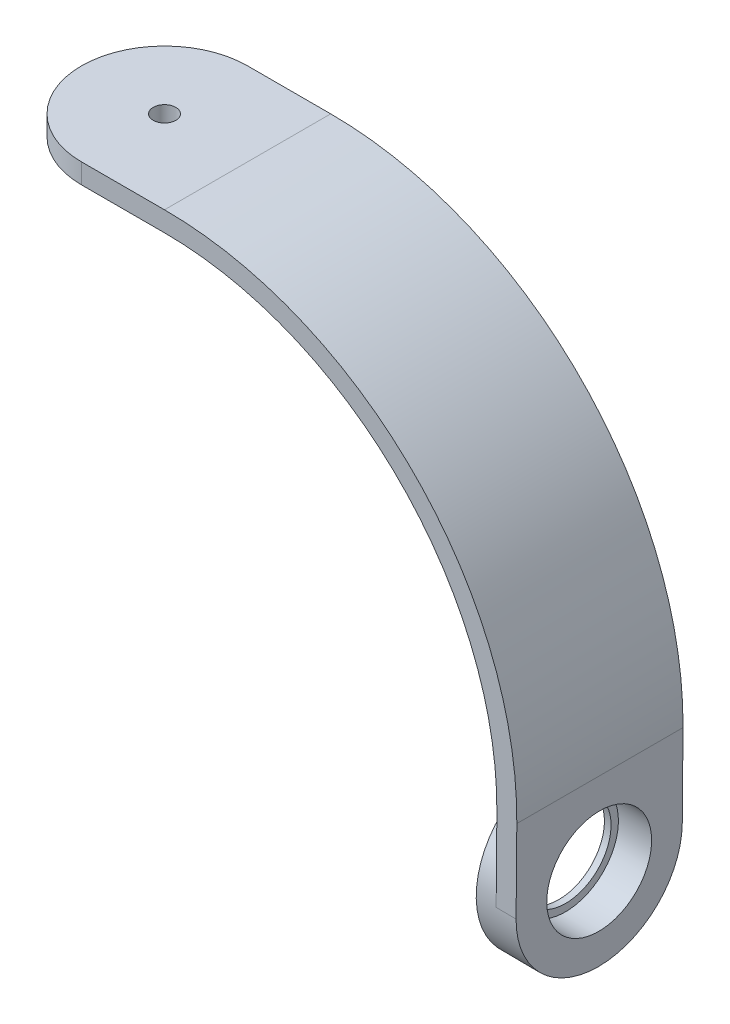
ISO-10303-21;
HEADER;
FILE_DESCRIPTION(('STEP AP214'),'2;1');
FILE_NAME('part.step','',(''),(''),'','','');
FILE_SCHEMA(('AUTOMOTIVE_DESIGN { 1 0 10303 214 1 1 1 1 }'));
ENDSEC;
DATA;
#1=APPLICATION_CONTEXT('core data for automotive mechanical design processes');
#2=APPLICATION_PROTOCOL_DEFINITION('international standard','automotive_design',2000,#1);
#3=PRODUCT_CONTEXT('',#1,'mechanical');
#4=PRODUCT('Part','Part','',(#3));
#5=PRODUCT_RELATED_PRODUCT_CATEGORY('part','',(#4));
#6=PRODUCT_DEFINITION_FORMATION('','',#4);
#7=PRODUCT_DEFINITION_CONTEXT('part definition',#1,'design');
#8=PRODUCT_DEFINITION('design','',#6,#7);
#9=PRODUCT_DEFINITION_SHAPE('','',#8);
#10=(LENGTH_UNIT() NAMED_UNIT(*) SI_UNIT(.MILLI.,.METRE.));
#11=(NAMED_UNIT(*) PLANE_ANGLE_UNIT() SI_UNIT($,.RADIAN.));
#12=(NAMED_UNIT(*) SI_UNIT($,.STERADIAN.) SOLID_ANGLE_UNIT());
#13=UNCERTAINTY_MEASURE_WITH_UNIT(LENGTH_MEASURE(1.E-05),#10,'distance_accuracy_value','');
#14=(GEOMETRIC_REPRESENTATION_CONTEXT(3) GLOBAL_UNCERTAINTY_ASSIGNED_CONTEXT((#13)) GLOBAL_UNIT_ASSIGNED_CONTEXT((#10,
#11,#12)) REPRESENTATION_CONTEXT('',''));
#15=CARTESIAN_POINT('',(0.,0.,0.));
#16=DIRECTION('',(0.,0.,1.));
#17=DIRECTION('',(1.,0.,0.));
#18=AXIS2_PLACEMENT_3D('',#15,#16,#17);
#19=CARTESIAN_POINT('',(46.8891286902864,-12.9096712067259,12.5));
#20=DIRECTION('',(0.999961923064171,-0.00872653549837705,0.));
#21=DIRECTION('',(0.00872653549837705,0.999961923064171,0.));
#22=AXIS2_PLACEMENT_3D('',#19,#20,#21);
#23=CYLINDRICAL_SURFACE('',#22,6.79);
#24=CARTESIAN_POINT('',(46.8891286902864,-12.9096712067259,12.5));
#25=DIRECTION('',(-0.999961923064171,0.00872653549837705,0.));
#26=DIRECTION('',(-0.00872653549837705,-0.999961923064171,0.));
#27=AXIS2_PLACEMENT_3D('',#24,#25,#26);
#28=CIRCLE('',#27,6.79);
#29=CARTESIAN_POINT('',(46.8298755142524,-19.6994126643316,12.5));
#30=VERTEX_POINT('',#29);
#31=EDGE_CURVE('E317',#30,#30,#28,.T.);
#32=ORIENTED_EDGE('',*,*,#31,.T.);
#33=EDGE_LOOP('',(#32));
#34=FACE_BOUND('',#33,.T.);
#35=CARTESIAN_POINT('',(47.8890906133506,-12.9183977422242,12.5));
#36=DIRECTION('',(0.999961923064171,-0.00872653549837732,0.));
#37=DIRECTION('',(0.00872653549837732,0.999961923064171,0.));
#38=AXIS2_PLACEMENT_3D('',#35,#36,#37);
#39=CIRCLE('',#38,6.79);
#40=CARTESIAN_POINT('',(47.9483437893845,-6.12865628461852,12.5));
#41=VERTEX_POINT('',#40);
#42=EDGE_CURVE('E49',#41,#41,#39,.T.);
#43=ORIENTED_EDGE('',*,*,#42,.T.);
#44=EDGE_LOOP('',(#43));
#45=FACE_BOUND('',#44,.T.);
#46=ADVANCED_FACE('F45',(#34,#45),#23,.F.);
#47=CARTESIAN_POINT('',(49.9980961532086,-0.436326774918869,25.));
#48=DIRECTION('',(0.999961923064171,-0.00872653549837705,0.));
#49=DIRECTION('',(0.00872653549837705,0.999961923064171,0.));
#50=AXIS2_PLACEMENT_3D('',#47,#48,#49);
#51=PLANE('',#50);
#52=CARTESIAN_POINT('',(49.8890144594789,-12.935850813221,12.5));
#53=DIRECTION('',(-0.999961923064171,0.00872653549837705,0.));
#54=DIRECTION('',(-0.00872653549837705,-0.999961923064171,0.));
#55=AXIS2_PLACEMENT_3D('',#52,#53,#54);
#56=CIRCLE('',#55,12.5);
#57=CARTESIAN_POINT('',(49.9980961532086,-0.436326774918864,12.5));
#58=VERTEX_POINT('',#57);
#59=CARTESIAN_POINT('',(49.8890144594788,-12.935850813221,0.));
#60=VERTEX_POINT('',#59);
#61=EDGE_CURVE('E63',#58,#60,#56,.T.);
#62=ORIENTED_EDGE('',*,*,#61,.F.);
#63=DIRECTION('',(0.,0.,-1.));
#64=VECTOR('',#63,1.);
#65=CARTESIAN_POINT('',(49.9980961532086,-0.436326774918869,25.));
#66=LINE('',#65,#64);
#67=CARTESIAN_POINT('',(49.9980961532086,-0.436326774918869,0.));
#68=VERTEX_POINT('',#67);
#69=EDGE_CURVE('E218',#58,#68,#66,.T.);
#70=ORIENTED_EDGE('',*,*,#69,.T.);
#71=DIRECTION('',(-0.00872653549837705,-0.999961923064171,0.));
#72=VECTOR('',#71,1.);
#73=CARTESIAN_POINT('',(49.9980961532086,-0.436326774918869,0.));
#74=LINE('',#73,#72);
#75=EDGE_CURVE('E254',#68,#60,#74,.T.);
#76=ORIENTED_EDGE('',*,*,#75,.T.);
#77=EDGE_LOOP('',(#62,#70,#76));
#78=FACE_BOUND('',#77,.T.);
#79=ADVANCED_FACE('F271',(#78),#51,.F.);
#80=CARTESIAN_POINT('',(0.,0.,25.));
#81=DIRECTION('',(0.,0.,-1.));
#82=DIRECTION('',(-1.,0.,0.));
#83=AXIS2_PLACEMENT_3D('',#80,#81,#82);
#84=CYLINDRICAL_SURFACE('',#83,50.);
#85=CARTESIAN_POINT('',(0.,0.,0.));
#86=DIRECTION('',(0.,0.,-1.));
#87=DIRECTION('',(-1.,0.,0.));
#88=AXIS2_PLACEMENT_3D('',#85,#86,#87);
#89=CIRCLE('',#88,50.);
#90=CARTESIAN_POINT('',(0.,50.,0.));
#91=VERTEX_POINT('',#90);
#92=EDGE_CURVE('E143',#91,#68,#89,.T.);
#93=ORIENTED_EDGE('',*,*,#92,.T.);
#94=ORIENTED_EDGE('',*,*,#69,.F.);
#95=CARTESIAN_POINT('',(49.9980961532086,-0.436326774918869,25.));
#96=VERTEX_POINT('',#95);
#97=EDGE_CURVE('E219',#96,#58,#66,.T.);
#98=ORIENTED_EDGE('',*,*,#97,.F.);
#99=CARTESIAN_POINT('',(0.,0.,25.));
#100=DIRECTION('',(0.,0.,-1.));
#101=DIRECTION('',(-1.,0.,0.));
#102=AXIS2_PLACEMENT_3D('',#99,#100,#101);
#103=CIRCLE('',#102,50.);
#104=CARTESIAN_POINT('',(0.,50.,25.));
#105=VERTEX_POINT('',#104);
#106=EDGE_CURVE('E202',#105,#96,#103,.T.);
#107=ORIENTED_EDGE('',*,*,#106,.F.);
#108=DIRECTION('',(0.,0.,-1.));
#109=VECTOR('',#108,1.);
#110=CARTESIAN_POINT('',(0.,50.,25.));
#111=LINE('',#110,#109);
#112=EDGE_CURVE('E208',#105,#91,#111,.T.);
#113=ORIENTED_EDGE('',*,*,#112,.T.);
#114=EDGE_LOOP('',(#93,#94,#98,#107,#113));
#115=FACE_BOUND('',#114,.T.);
#116=ADVANCED_FACE('F279',(#115),#84,.F.);
#117=CARTESIAN_POINT('',(49.8890144594788,-12.935850813221,25.));
#118=VERTEX_POINT('',#117);
#119=EDGE_CURVE('E323',#118,#58,#56,.T.);
#120=ORIENTED_EDGE('',*,*,#119,.F.);
#121=DIRECTION('',(-0.00872653549837705,-0.999961923064171,0.));
#122=VECTOR('',#121,1.);
#123=CARTESIAN_POINT('',(49.9980961532086,-0.436326774918869,25.));
#124=LINE('',#123,#122);
#125=EDGE_CURVE('E237',#96,#118,#124,.T.);
#126=ORIENTED_EDGE('',*,*,#125,.F.);
#127=ORIENTED_EDGE('',*,*,#97,.T.);
#128=EDGE_LOOP('',(#120,#126,#127));
#129=FACE_BOUND('',#128,.T.);
#130=ADVANCED_FACE('F267',(#129),#51,.F.);
#131=CARTESIAN_POINT('',(52.7798185349417,-25.4615544580183,25.));
#132=DIRECTION('',(-0.999961923064171,0.00872653549837732,0.));
#133=DIRECTION('',(-0.00872653549837732,-0.999961923064171,0.));
#134=AXIS2_PLACEMENT_3D('',#131,#132,#133);
#135=PLANE('',#134);
#136=CARTESIAN_POINT('',(52.8889002286714,-12.9620304197161,12.5));
#137=DIRECTION('',(0.999961923064171,-0.00872653549837746,0.));
#138=DIRECTION('',(0.00872653549837746,0.999961923064171,0.));
#139=AXIS2_PLACEMENT_3D('',#136,#137,#138);
#140=CIRCLE('',#139,7.89);
#141=CARTESIAN_POINT('',(52.9577525937536,-5.07233084673982,12.5));
#142=VERTEX_POINT('',#141);
#143=EDGE_CURVE('E137',#142,#142,#140,.T.);
#144=ORIENTED_EDGE('',*,*,#143,.F.);
#145=EDGE_LOOP('',(#144));
#146=FACE_BOUND('',#145,.T.);
#147=CARTESIAN_POINT('',(52.8889002286714,-12.9620304197161,12.5));
#148=DIRECTION('',(-0.999961923064171,0.00872653549837732,0.));
#149=DIRECTION('',(-0.00872653549837732,-0.999961923064171,0.));
#150=AXIS2_PLACEMENT_3D('',#147,#148,#149);
#151=CIRCLE('',#150,12.5);
#152=CARTESIAN_POINT('',(52.8889002286714,-12.9620304197161,25.));
#153=VERTEX_POINT('',#152);
#154=CARTESIAN_POINT('',(52.7798185349417,-25.4615544580183,12.5));
#155=VERTEX_POINT('',#154);
#156=EDGE_CURVE('E223',#153,#155,#151,.F.);
#157=ORIENTED_EDGE('',*,*,#156,.T.);
#158=CARTESIAN_POINT('',(52.8889002286714,-12.9620304197161,12.5));
#159=DIRECTION('',(-0.999961923064171,0.00872653549837732,0.));
#160=DIRECTION('',(-0.00872653549837732,-0.999961923064171,0.));
#161=AXIS2_PLACEMENT_3D('',#158,#159,#160);
#162=CIRCLE('',#161,12.5);
#163=CARTESIAN_POINT('',(52.8889002286714,-12.9620304197161,0.));
#164=VERTEX_POINT('',#163);
#165=EDGE_CURVE('E135',#155,#164,#162,.F.);
#166=ORIENTED_EDGE('',*,*,#165,.T.);
#167=DIRECTION('',(0.00872653549837732,0.999961923064171,0.));
#168=VECTOR('',#167,1.);
#169=CARTESIAN_POINT('',(52.7798185349417,-25.4615544580183,0.));
#170=LINE('',#169,#168);
#171=CARTESIAN_POINT('',(52.9979819224011,-0.462506381413972,0.));
#172=VERTEX_POINT('',#171);
#173=EDGE_CURVE('E204',#164,#172,#170,.T.);
#174=ORIENTED_EDGE('',*,*,#173,.T.);
#175=DIRECTION('',(0.,0.,-1.));
#176=VECTOR('',#175,1.);
#177=CARTESIAN_POINT('',(52.9979819224011,-0.462506381413972,25.));
#178=LINE('',#177,#176);
#179=CARTESIAN_POINT('',(52.9979819224011,-0.462506381413972,25.));
#180=VERTEX_POINT('',#179);
#181=EDGE_CURVE('E214',#180,#172,#178,.T.);
#182=ORIENTED_EDGE('',*,*,#181,.F.);
#183=DIRECTION('',(0.00872653549837732,0.999961923064171,0.));
#184=VECTOR('',#183,1.);
#185=CARTESIAN_POINT('',(52.7798185349417,-25.4615544580183,25.));
#186=LINE('',#185,#184);
#187=EDGE_CURVE('E234',#153,#180,#186,.T.);
#188=ORIENTED_EDGE('',*,*,#187,.F.);
#189=EDGE_LOOP('',(#157,#166,#174,#182,#188));
#190=FACE_BOUND('',#189,.T.);
#191=ADVANCED_FACE('F240',(#146,#190),#135,.F.);
#192=CARTESIAN_POINT('',(0.,0.,25.));
#193=DIRECTION('',(0.,0.,-1.));
#194=DIRECTION('',(-1.,0.,0.));
#195=AXIS2_PLACEMENT_3D('',#192,#193,#194);
#196=CYLINDRICAL_SURFACE('',#195,53.);
#197=CARTESIAN_POINT('',(0.,0.,0.));
#198=DIRECTION('',(0.,0.,1.));
#199=DIRECTION('',(-1.,0.,0.));
#200=AXIS2_PLACEMENT_3D('',#197,#198,#199);
#201=CIRCLE('',#200,53.);
#202=CARTESIAN_POINT('',(0.,53.,0.));
#203=VERTEX_POINT('',#202);
#204=EDGE_CURVE('E198',#172,#203,#201,.T.);
#205=ORIENTED_EDGE('',*,*,#204,.T.);
#206=DIRECTION('',(0.,0.,-1.));
#207=VECTOR('',#206,1.);
#208=CARTESIAN_POINT('',(0.,53.,25.));
#209=LINE('',#208,#207);
#210=CARTESIAN_POINT('',(0.,53.,25.));
#211=VERTEX_POINT('',#210);
#212=EDGE_CURVE('E196',#211,#203,#209,.T.);
#213=ORIENTED_EDGE('',*,*,#212,.F.);
#214=CARTESIAN_POINT('',(0.,0.,25.));
#215=DIRECTION('',(0.,0.,1.));
#216=DIRECTION('',(-1.,0.,0.));
#217=AXIS2_PLACEMENT_3D('',#214,#215,#216);
#218=CIRCLE('',#217,53.);
#219=EDGE_CURVE('E176',#180,#211,#218,.T.);
#220=ORIENTED_EDGE('',*,*,#219,.F.);
#221=ORIENTED_EDGE('',*,*,#181,.T.);
#222=EDGE_LOOP('',(#205,#213,#220,#221));
#223=FACE_BOUND('',#222,.T.);
#224=ADVANCED_FACE('F258',(#223),#196,.T.);
#225=CARTESIAN_POINT('',(0.,53.,25.));
#226=DIRECTION('',(0.,-1.,0.));
#227=DIRECTION('',(0.,0.,-1.));
#228=AXIS2_PLACEMENT_3D('',#225,#226,#227);
#229=PLANE('',#228);
#230=CARTESIAN_POINT('',(-12.5,53.,12.5));
#231=DIRECTION('',(0.,1.,0.));
#232=DIRECTION('',(0.,0.,1.));
#233=AXIS2_PLACEMENT_3D('',#230,#231,#232);
#234=CIRCLE('',#233,1.7);
#235=CARTESIAN_POINT('',(-12.5,53.,14.2));
#236=VERTEX_POINT('',#235);
#237=EDGE_CURVE('E308',#236,#236,#234,.T.);
#238=ORIENTED_EDGE('',*,*,#237,.F.);
#239=EDGE_LOOP('',(#238));
#240=FACE_BOUND('',#239,.T.);
#241=CARTESIAN_POINT('',(-12.5,53.,12.5));
#242=DIRECTION('',(0.,-1.,0.));
#243=DIRECTION('',(0.,0.,-1.));
#244=AXIS2_PLACEMENT_3D('',#241,#242,#243);
#245=CIRCLE('',#244,12.5);
#246=CARTESIAN_POINT('',(-12.5,53.,0.));
#247=VERTEX_POINT('',#246);
#248=CARTESIAN_POINT('',(-25.,53.,12.5));
#249=VERTEX_POINT('',#248);
#250=EDGE_CURVE('E71',#247,#249,#245,.F.);
#251=ORIENTED_EDGE('',*,*,#250,.T.);
#252=CARTESIAN_POINT('',(-12.5,53.,12.5));
#253=DIRECTION('',(0.,-1.,0.));
#254=DIRECTION('',(0.,0.,-1.));
#255=AXIS2_PLACEMENT_3D('',#252,#253,#254);
#256=CIRCLE('',#255,12.5);
#257=CARTESIAN_POINT('',(-12.5,53.,25.));
#258=VERTEX_POINT('',#257);
#259=EDGE_CURVE('E55',#249,#258,#256,.F.);
#260=ORIENTED_EDGE('',*,*,#259,.T.);
#261=DIRECTION('',(-1.,0.,0.));
#262=VECTOR('',#261,1.);
#263=CARTESIAN_POINT('',(0.,53.,25.));
#264=LINE('',#263,#262);
#265=EDGE_CURVE('E169',#211,#258,#264,.T.);
#266=ORIENTED_EDGE('',*,*,#265,.F.);
#267=ORIENTED_EDGE('',*,*,#212,.T.);
#268=DIRECTION('',(-1.,0.,0.));
#269=VECTOR('',#268,1.);
#270=CARTESIAN_POINT('',(0.,53.,0.));
#271=LINE('',#270,#269);
#272=EDGE_CURVE('E193',#203,#247,#271,.T.);
#273=ORIENTED_EDGE('',*,*,#272,.T.);
#274=EDGE_LOOP('',(#251,#260,#266,#267,#273));
#275=FACE_BOUND('',#274,.T.);
#276=ADVANCED_FACE('F167',(#240,#275),#229,.F.);
#277=CARTESIAN_POINT('',(-25.,50.,25.));
#278=DIRECTION('',(0.,1.,0.));
#279=DIRECTION('',(0.,0.,1.));
#280=AXIS2_PLACEMENT_3D('',#277,#278,#279);
#281=PLANE('',#280);
#282=CARTESIAN_POINT('',(-12.5,50.,12.5));
#283=DIRECTION('',(0.,1.,0.));
#284=DIRECTION('',(0.,0.,1.));
#285=AXIS2_PLACEMENT_3D('',#282,#283,#284);
#286=CIRCLE('',#285,1.7);
#287=CARTESIAN_POINT('',(-12.5,50.,14.2));
#288=VERTEX_POINT('',#287);
#289=EDGE_CURVE('E304',#288,#288,#286,.F.);
#290=ORIENTED_EDGE('',*,*,#289,.F.);
#291=EDGE_LOOP('',(#290));
#292=FACE_BOUND('',#291,.T.);
#293=DIRECTION('',(1.,0.,0.));
#294=VECTOR('',#293,1.);
#295=CARTESIAN_POINT('',(-25.,50.,25.));
#296=LINE('',#295,#294);
#297=CARTESIAN_POINT('',(-12.5,50.,25.));
#298=VERTEX_POINT('',#297);
#299=EDGE_CURVE('E179',#298,#105,#296,.T.);
#300=ORIENTED_EDGE('',*,*,#299,.F.);
#301=CARTESIAN_POINT('',(-12.5,50.,12.5));
#302=DIRECTION('',(0.,1.,0.));
#303=DIRECTION('',(0.,0.,1.));
#304=AXIS2_PLACEMENT_3D('',#301,#302,#303);
#305=CIRCLE('',#304,12.5);
#306=CARTESIAN_POINT('',(-25.,50.,12.5));
#307=VERTEX_POINT('',#306);
#308=EDGE_CURVE('E158',#298,#307,#305,.F.);
#309=ORIENTED_EDGE('',*,*,#308,.T.);
#310=CARTESIAN_POINT('',(-12.5,50.,12.5));
#311=DIRECTION('',(0.,1.,0.));
#312=DIRECTION('',(0.,0.,1.));
#313=AXIS2_PLACEMENT_3D('',#310,#311,#312);
#314=CIRCLE('',#313,12.5);
#315=CARTESIAN_POINT('',(-12.5,50.,0.));
#316=VERTEX_POINT('',#315);
#317=EDGE_CURVE('E155',#307,#316,#314,.F.);
#318=ORIENTED_EDGE('',*,*,#317,.T.);
#319=DIRECTION('',(1.,0.,0.));
#320=VECTOR('',#319,1.);
#321=CARTESIAN_POINT('',(-25.,50.,0.));
#322=LINE('',#321,#320);
#323=EDGE_CURVE('E195',#316,#91,#322,.T.);
#324=ORIENTED_EDGE('',*,*,#323,.T.);
#325=ORIENTED_EDGE('',*,*,#112,.F.);
#326=EDGE_LOOP('',(#300,#309,#318,#324,#325));
#327=FACE_BOUND('',#326,.T.);
#328=ADVANCED_FACE('F184',(#292,#327),#281,.F.);
#329=CARTESIAN_POINT('',(0.,0.,25.));
#330=DIRECTION('',(0.,0.,-1.));
#331=DIRECTION('',(-1.,0.,0.));
#332=AXIS2_PLACEMENT_3D('',#329,#330,#331);
#333=PLANE('',#332);
#334=ORIENTED_EDGE('',*,*,#265,.T.);
#335=DIRECTION('',(0.,-1.,0.));
#336=VECTOR('',#335,1.);
#337=CARTESIAN_POINT('',(-12.5,0.,25.));
#338=LINE('',#337,#336);
#339=EDGE_CURVE('E151',#258,#298,#338,.T.);
#340=ORIENTED_EDGE('',*,*,#339,.T.);
#341=ORIENTED_EDGE('',*,*,#299,.T.);
#342=ORIENTED_EDGE('',*,*,#106,.T.);
#343=ORIENTED_EDGE('',*,*,#125,.T.);
#344=DIRECTION('',(0.999961923064171,-0.00872653549837649,0.));
#345=VECTOR('',#344,1.);
#346=CARTESIAN_POINT('',(-0.109081693729706,-12.4995240383022,25.));
#347=LINE('',#346,#345);
#348=EDGE_CURVE('E149',#118,#153,#347,.T.);
#349=ORIENTED_EDGE('',*,*,#348,.T.);
#350=ORIENTED_EDGE('',*,*,#187,.T.);
#351=ORIENTED_EDGE('',*,*,#219,.T.);
#352=EDGE_LOOP('',(#334,#340,#341,#342,#343,#349,#350,#351));
#353=FACE_BOUND('',#352,.T.);
#354=ADVANCED_FACE('F173',(#353),#333,.F.);
#355=CARTESIAN_POINT('',(0.,0.,0.));
#356=DIRECTION('',(0.,0.,-1.));
#357=DIRECTION('',(-1.,0.,0.));
#358=AXIS2_PLACEMENT_3D('',#355,#356,#357);
#359=PLANE('',#358);
#360=ORIENTED_EDGE('',*,*,#323,.F.);
#361=DIRECTION('',(0.,-1.,0.));
#362=VECTOR('',#361,1.);
#363=CARTESIAN_POINT('',(-12.5,53.,0.));
#364=LINE('',#363,#362);
#365=EDGE_CURVE('E11',#316,#247,#364,.F.);
#366=ORIENTED_EDGE('',*,*,#365,.T.);
#367=ORIENTED_EDGE('',*,*,#272,.F.);
#368=ORIENTED_EDGE('',*,*,#204,.F.);
#369=ORIENTED_EDGE('',*,*,#173,.F.);
#370=DIRECTION('',(0.999961923064171,-0.00872653549837649,0.));
#371=VECTOR('',#370,1.);
#372=CARTESIAN_POINT('',(49.8890144594788,-12.935850813221,0.));
#373=LINE('',#372,#371);
#374=EDGE_CURVE('E227',#164,#60,#373,.F.);
#375=ORIENTED_EDGE('',*,*,#374,.T.);
#376=ORIENTED_EDGE('',*,*,#75,.F.);
#377=ORIENTED_EDGE('',*,*,#92,.F.);
#378=EDGE_LOOP('',(#360,#366,#367,#368,#369,#375,#376,#377));
#379=FACE_BOUND('',#378,.T.);
#380=ADVANCED_FACE('F191',(#379),#359,.T.);
#381=CARTESIAN_POINT('',(-25.5706753038236,-12.2773240771247,12.5));
#382=DIRECTION('',(0.999961923064171,-0.00872653549837746,0.));
#383=DIRECTION('',(0.00872653549837746,0.999961923064171,0.));
#384=AXIS2_PLACEMENT_3D('',#381,#382,#383);
#385=CYLINDRICAL_SURFACE('',#384,7.89);
#386=ORIENTED_EDGE('',*,*,#143,.T.);
#387=EDGE_LOOP('',(#386));
#388=FACE_BOUND('',#387,.T.);
#389=CARTESIAN_POINT('',(47.8890906133506,-12.9183977422242,12.5));
#390=DIRECTION('',(0.999961923064171,-0.00872653549837732,0.));
#391=DIRECTION('',(0.00872653549837732,0.999961923064171,0.));
#392=AXIS2_PLACEMENT_3D('',#389,#390,#391);
#393=CIRCLE('',#392,7.89000000000001);
#394=CARTESIAN_POINT('',(47.9579429784327,-5.02869816924793,12.5));
#395=VERTEX_POINT('',#394);
#396=EDGE_CURVE('E307',#395,#395,#393,.T.);
#397=ORIENTED_EDGE('',*,*,#396,.F.);
#398=EDGE_LOOP('',(#397));
#399=FACE_BOUND('',#398,.T.);
#400=ADVANCED_FACE('F290',(#388,#399),#385,.F.);
#401=CARTESIAN_POINT('',(-0.109081693729706,-12.4995240383022,12.5));
#402=DIRECTION('',(0.999961923064171,-0.00872653549837649,0.));
#403=DIRECTION('',(0.00872653549837649,0.999961923064171,0.));
#404=AXIS2_PLACEMENT_3D('',#401,#402,#403);
#405=CYLINDRICAL_SURFACE('',#404,12.5);
#406=ORIENTED_EDGE('',*,*,#348,.F.);
#407=ORIENTED_EDGE('',*,*,#119,.T.);
#408=ORIENTED_EDGE('',*,*,#61,.T.);
#409=ORIENTED_EDGE('',*,*,#374,.F.);
#410=ORIENTED_EDGE('',*,*,#165,.F.);
#411=DIRECTION('',(0.999961923064171,-0.00872653549837649,0.));
#412=VECTOR('',#411,1.);
#413=CARTESIAN_POINT('',(49.7799327657491,-25.4353748515231,12.5));
#414=LINE('',#413,#412);
#415=CARTESIAN_POINT('',(49.7799327657492,-25.4353748515231,12.5));
#416=VERTEX_POINT('',#415);
#417=EDGE_CURVE('E129',#155,#416,#414,.F.);
#418=ORIENTED_EDGE('',*,*,#417,.T.);
#419=ORIENTED_EDGE('',*,*,#417,.F.);
#420=ORIENTED_EDGE('',*,*,#156,.F.);
#421=EDGE_LOOP('',(#406,#407,#408,#409,#410,#418,#419,#420));
#422=FACE_BOUND('',#421,.T.);
#423=CARTESIAN_POINT('',(46.8891286902864,-12.9096712067259,12.5));
#424=DIRECTION('',(-0.999961923064171,0.00872653549837705,0.));
#425=DIRECTION('',(-0.00872653549837705,-0.999961923064171,0.));
#426=AXIS2_PLACEMENT_3D('',#423,#424,#425);
#427=CIRCLE('',#426,12.5);
#428=CARTESIAN_POINT('',(46.7800469965566,-25.409195245028,12.5));
#429=VERTEX_POINT('',#428);
#430=EDGE_CURVE('E146',#429,#429,#427,.T.);
#431=ORIENTED_EDGE('',*,*,#430,.F.);
#432=EDGE_LOOP('',(#431));
#433=FACE_BOUND('',#432,.T.);
#434=ADVANCED_FACE('F131',(#422,#433),#405,.T.);
#435=CARTESIAN_POINT('',(-12.5,53.,12.5));
#436=DIRECTION('',(0.,1.,0.));
#437=DIRECTION('',(0.,0.,1.));
#438=AXIS2_PLACEMENT_3D('',#435,#436,#437);
#439=CYLINDRICAL_SURFACE('',#438,12.5);
#440=DIRECTION('',(0.,-1.,0.));
#441=VECTOR('',#440,1.);
#442=CARTESIAN_POINT('',(-25.,50.,12.5));
#443=LINE('',#442,#441);
#444=EDGE_CURVE('E138',#249,#307,#443,.T.);
#445=ORIENTED_EDGE('',*,*,#444,.F.);
#446=ORIENTED_EDGE('',*,*,#250,.F.);
#447=ORIENTED_EDGE('',*,*,#365,.F.);
#448=ORIENTED_EDGE('',*,*,#317,.F.);
#449=EDGE_LOOP('',(#445,#446,#447,#448));
#450=FACE_BOUND('',#449,.T.);
#451=ADVANCED_FACE('F47',(#450),#439,.T.);
#452=CARTESIAN_POINT('',(-12.5,0.,12.5));
#453=DIRECTION('',(0.,-1.,0.));
#454=DIRECTION('',(0.,0.,-1.));
#455=AXIS2_PLACEMENT_3D('',#452,#453,#454);
#456=CYLINDRICAL_SURFACE('',#455,12.5);
#457=ORIENTED_EDGE('',*,*,#259,.F.);
#458=ORIENTED_EDGE('',*,*,#444,.T.);
#459=ORIENTED_EDGE('',*,*,#308,.F.);
#460=ORIENTED_EDGE('',*,*,#339,.F.);
#461=EDGE_LOOP('',(#457,#458,#459,#460));
#462=FACE_BOUND('',#461,.T.);
#463=ADVANCED_FACE('F181',(#462),#456,.T.);
#464=CARTESIAN_POINT('',(46.8891286902864,-12.9096712067259,12.5));
#465=DIRECTION('',(-0.999961923064171,0.00872653549837705,0.));
#466=DIRECTION('',(-0.00872653549837705,-0.999961923064171,0.));
#467=AXIS2_PLACEMENT_3D('',#464,#465,#466);
#468=PLANE('',#467);
#469=ORIENTED_EDGE('',*,*,#430,.T.);
#470=EDGE_LOOP('',(#469));
#471=FACE_BOUND('',#470,.T.);
#472=ORIENTED_EDGE('',*,*,#31,.F.);
#473=EDGE_LOOP('',(#472));
#474=FACE_BOUND('',#473,.T.);
#475=ADVANCED_FACE('F287',(#471,#474),#468,.T.);
#476=CARTESIAN_POINT('',(47.8890906133506,-12.9183977422242,12.5));
#477=DIRECTION('',(0.999961923064171,-0.00872653549837732,0.));
#478=DIRECTION('',(0.00872653549837732,0.999961923064171,0.));
#479=AXIS2_PLACEMENT_3D('',#476,#477,#478);
#480=PLANE('',#479);
#481=ORIENTED_EDGE('',*,*,#42,.F.);
#482=EDGE_LOOP('',(#481));
#483=FACE_BOUND('',#482,.T.);
#484=ORIENTED_EDGE('',*,*,#396,.T.);
#485=EDGE_LOOP('',(#484));
#486=FACE_BOUND('',#485,.T.);
#487=ADVANCED_FACE('F285',(#483,#486),#480,.T.);
#488=CARTESIAN_POINT('',(-12.5,-25.4625544580183,12.5));
#489=DIRECTION('',(0.,1.,0.));
#490=DIRECTION('',(0.,0.,1.));
#491=AXIS2_PLACEMENT_3D('',#488,#489,#490);
#492=CYLINDRICAL_SURFACE('',#491,1.7);
#493=ORIENTED_EDGE('',*,*,#237,.T.);
#494=EDGE_LOOP('',(#493));
#495=FACE_BOUND('',#494,.T.);
#496=ORIENTED_EDGE('',*,*,#289,.T.);
#497=EDGE_LOOP('',(#496));
#498=FACE_BOUND('',#497,.T.);
#499=ADVANCED_FACE('F337',(#495,#498),#492,.F.);
#500=CLOSED_SHELL('',(#46,#79,#116,#130,#191,#224,#276,#328,#354,#380,#400,#434,#451,#463,#475,
#487,#499));
#501=MANIFOLD_SOLID_BREP('B2',#500);
#502=ADVANCED_BREP_SHAPE_REPRESENTATION('',(#18,#501),#14);
#503=SHAPE_DEFINITION_REPRESENTATION(#9,#502);
ENDSEC;
END-ISO-10303-21;
